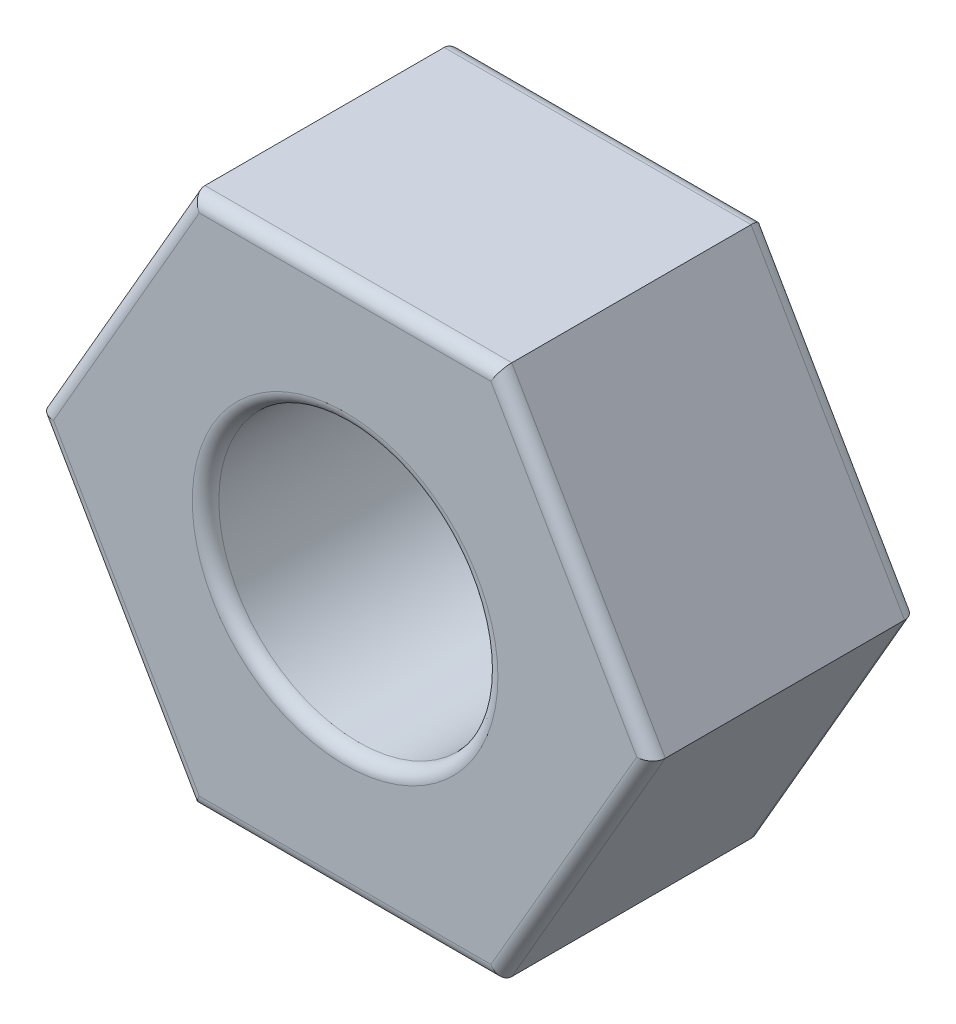
ISO-10303-21;
HEADER;
FILE_DESCRIPTION(('STEP AP214'),'2;1');
FILE_NAME('part.step','',(''),(''),'','','');
FILE_SCHEMA(('AUTOMOTIVE_DESIGN { 1 0 10303 214 1 1 1 1 }'));
ENDSEC;
DATA;
#1=APPLICATION_CONTEXT('core data for automotive mechanical design processes');
#2=APPLICATION_PROTOCOL_DEFINITION('international standard','automotive_design',2000,#1);
#3=PRODUCT_CONTEXT('',#1,'mechanical');
#4=PRODUCT('Part','Part','',(#3));
#5=PRODUCT_RELATED_PRODUCT_CATEGORY('part','',(#4));
#6=PRODUCT_DEFINITION_FORMATION('','',#4);
#7=PRODUCT_DEFINITION_CONTEXT('part definition',#1,'design');
#8=PRODUCT_DEFINITION('design','',#6,#7);
#9=PRODUCT_DEFINITION_SHAPE('','',#8);
#10=(LENGTH_UNIT() NAMED_UNIT(*) SI_UNIT(.MILLI.,.METRE.));
#11=(NAMED_UNIT(*) PLANE_ANGLE_UNIT() SI_UNIT($,.RADIAN.));
#12=(NAMED_UNIT(*) SI_UNIT($,.STERADIAN.) SOLID_ANGLE_UNIT());
#13=UNCERTAINTY_MEASURE_WITH_UNIT(LENGTH_MEASURE(1.E-05),#10,'distance_accuracy_value','');
#14=(GEOMETRIC_REPRESENTATION_CONTEXT(3) GLOBAL_UNCERTAINTY_ASSIGNED_CONTEXT((#13)) GLOBAL_UNIT_ASSIGNED_CONTEXT((#10,
#11,#12)) REPRESENTATION_CONTEXT('',''));
#15=CARTESIAN_POINT('',(0.,0.,0.));
#16=DIRECTION('',(0.,0.,1.));
#17=DIRECTION('',(1.,0.,0.));
#18=AXIS2_PLACEMENT_3D('',#15,#16,#17);
#19=CARTESIAN_POINT('',(0.,0.,4.));
#20=DIRECTION('',(0.,0.,1.));
#21=DIRECTION('',(1.,0.,0.));
#22=AXIS2_PLACEMENT_3D('',#19,#20,#21);
#23=PLANE('',#22);
#24=CARTESIAN_POINT('',(0.,0.,4.));
#25=DIRECTION('',(0.,0.,1.));
#26=DIRECTION('',(1.,0.,0.));
#27=AXIS2_PLACEMENT_3D('',#24,#25,#26);
#28=CIRCLE('',#27,2.3);
#29=CARTESIAN_POINT('',(2.3,0.,4.));
#30=VERTEX_POINT('',#29);
#31=EDGE_CURVE('E11',#30,#30,#28,.F.);
#32=ORIENTED_EDGE('',*,*,#31,.T.);
#33=EDGE_LOOP('',(#32));
#34=FACE_BOUND('',#33,.T.);
#35=DIRECTION('',(0.5,-0.866025403784439,0.));
#36=VECTOR('',#35,1.);
#37=CARTESIAN_POINT('',(-2.13619599600161,-3.9,4.));
#38=LINE('',#37,#36);
#39=CARTESIAN_POINT('',(-4.38786204584116,0.,4.));
#40=VERTEX_POINT('',#39);
#41=CARTESIAN_POINT('',(-2.19393102292058,-3.8,4.));
#42=VERTEX_POINT('',#41);
#43=EDGE_CURVE('E51',#40,#42,#38,.T.);
#44=ORIENTED_EDGE('',*,*,#43,.T.);
#45=DIRECTION('',(1.,0.,0.));
#46=VECTOR('',#45,1.);
#47=CARTESIAN_POINT('',(2.3094010767585,-3.8,4.));
#48=LINE('',#47,#46);
#49=CARTESIAN_POINT('',(2.19393102292058,-3.8,4.));
#50=VERTEX_POINT('',#49);
#51=EDGE_CURVE('E43',#42,#50,#48,.T.);
#52=ORIENTED_EDGE('',*,*,#51,.T.);
#53=DIRECTION('',(0.499999999999999,0.866025403784439,0.));
#54=VECTOR('',#53,1.);
#55=CARTESIAN_POINT('',(4.44559707276012,0.100000000000003,4.));
#56=LINE('',#55,#54);
#57=CARTESIAN_POINT('',(4.38786204584116,0.,4.));
#58=VERTEX_POINT('',#57);
#59=EDGE_CURVE('E190',#50,#58,#56,.T.);
#60=ORIENTED_EDGE('',*,*,#59,.T.);
#61=DIRECTION('',(-0.5,0.866025403784439,0.));
#62=VECTOR('',#61,1.);
#63=CARTESIAN_POINT('',(2.13619599600161,3.9,4.));
#64=LINE('',#63,#62);
#65=CARTESIAN_POINT('',(2.19393102292058,3.8,4.));
#66=VERTEX_POINT('',#65);
#67=EDGE_CURVE('E192',#58,#66,#64,.T.);
#68=ORIENTED_EDGE('',*,*,#67,.T.);
#69=DIRECTION('',(-1.,0.,0.));
#70=VECTOR('',#69,1.);
#71=CARTESIAN_POINT('',(-2.3094010767585,3.8,4.));
#72=LINE('',#71,#70);
#73=CARTESIAN_POINT('',(-2.19393102292058,3.8,4.));
#74=VERTEX_POINT('',#73);
#75=EDGE_CURVE('E194',#66,#74,#72,.T.);
#76=ORIENTED_EDGE('',*,*,#75,.T.);
#77=DIRECTION('',(-0.499999999999999,-0.866025403784439,0.));
#78=VECTOR('',#77,1.);
#79=CARTESIAN_POINT('',(-4.44559707276012,-0.100000000000003,4.));
#80=LINE('',#79,#78);
#81=EDGE_CURVE('E56',#74,#40,#80,.T.);
#82=ORIENTED_EDGE('',*,*,#81,.T.);
#83=EDGE_LOOP('',(#44,#52,#60,#68,#76,#82));
#84=FACE_BOUND('',#83,.T.);
#85=ADVANCED_FACE('F34',(#34,#84),#23,.T.);
#86=CARTESIAN_POINT('',(0.,0.,0.));
#87=DIRECTION('',(0.,0.,1.));
#88=DIRECTION('',(1.,0.,0.));
#89=AXIS2_PLACEMENT_3D('',#86,#87,#88);
#90=PLANE('',#89);
#91=CARTESIAN_POINT('',(0.,0.,0.));
#92=DIRECTION('',(0.,0.,1.));
#93=DIRECTION('',(1.,0.,0.));
#94=AXIS2_PLACEMENT_3D('',#91,#92,#93);
#95=CIRCLE('',#94,2.3);
#96=CARTESIAN_POINT('',(2.3,0.,0.));
#97=VERTEX_POINT('',#96);
#98=EDGE_CURVE('E152',#97,#97,#95,.T.);
#99=ORIENTED_EDGE('',*,*,#98,.T.);
#100=EDGE_LOOP('',(#99));
#101=FACE_BOUND('',#100,.T.);
#102=DIRECTION('',(-1.,0.,0.));
#103=VECTOR('',#102,1.);
#104=CARTESIAN_POINT('',(0.,3.8,0.));
#105=LINE('',#104,#103);
#106=CARTESIAN_POINT('',(-2.19393102292058,3.8,0.));
#107=VERTEX_POINT('',#106);
#108=CARTESIAN_POINT('',(2.19393102292058,3.8,0.));
#109=VERTEX_POINT('',#108);
#110=EDGE_CURVE('E151',#107,#109,#105,.F.);
#111=ORIENTED_EDGE('',*,*,#110,.T.);
#112=DIRECTION('',(-0.5,0.866025403784439,0.));
#113=VECTOR('',#112,1.);
#114=CARTESIAN_POINT('',(3.29089653438087,1.9,0.));
#115=LINE('',#114,#113);
#116=CARTESIAN_POINT('',(4.38786204584116,0.,0.));
#117=VERTEX_POINT('',#116);
#118=EDGE_CURVE('E130',#109,#117,#115,.F.);
#119=ORIENTED_EDGE('',*,*,#118,.T.);
#120=DIRECTION('',(0.499999999999999,0.866025403784439,0.));
#121=VECTOR('',#120,1.);
#122=CARTESIAN_POINT('',(3.29089653438087,-1.9,0.));
#123=LINE('',#122,#121);
#124=CARTESIAN_POINT('',(2.19393102292058,-3.8,0.));
#125=VERTEX_POINT('',#124);
#126=EDGE_CURVE('E140',#117,#125,#123,.F.);
#127=ORIENTED_EDGE('',*,*,#126,.T.);
#128=DIRECTION('',(1.,0.,0.));
#129=VECTOR('',#128,1.);
#130=CARTESIAN_POINT('',(0.,-3.8,0.));
#131=LINE('',#130,#129);
#132=CARTESIAN_POINT('',(-2.19393102292058,-3.8,0.));
#133=VERTEX_POINT('',#132);
#134=EDGE_CURVE('E146',#125,#133,#131,.F.);
#135=ORIENTED_EDGE('',*,*,#134,.T.);
#136=DIRECTION('',(0.5,-0.866025403784439,0.));
#137=VECTOR('',#136,1.);
#138=CARTESIAN_POINT('',(-3.29089653438087,-1.9,0.));
#139=LINE('',#138,#137);
#140=CARTESIAN_POINT('',(-4.38786204584116,0.,0.));
#141=VERTEX_POINT('',#140);
#142=EDGE_CURVE('E252',#133,#141,#139,.F.);
#143=ORIENTED_EDGE('',*,*,#142,.T.);
#144=DIRECTION('',(-0.499999999999999,-0.866025403784439,0.));
#145=VECTOR('',#144,1.);
#146=CARTESIAN_POINT('',(-3.29089653438087,1.9,0.));
#147=LINE('',#146,#145);
#148=EDGE_CURVE('E157',#141,#107,#147,.F.);
#149=ORIENTED_EDGE('',*,*,#148,.T.);
#150=EDGE_LOOP('',(#111,#119,#127,#135,#143,#149));
#151=FACE_BOUND('',#150,.T.);
#152=ADVANCED_FACE('F149',(#101,#151),#90,.F.);
#153=CARTESIAN_POINT('',(2.3094010767585,-4.,4.));
#154=DIRECTION('',(-0.866025403784439,0.499999999999999,0.));
#155=DIRECTION('',(-0.499999999999999,-0.866025403784439,0.));
#156=AXIS2_PLACEMENT_3D('',#153,#154,#155);
#157=PLANE('',#156);
#158=DIRECTION('',(0.,0.,-1.));
#159=VECTOR('',#158,1.);
#160=CARTESIAN_POINT('',(2.3094010767585,-4.,4.));
#161=LINE('',#160,#159);
#162=CARTESIAN_POINT('',(2.3094010767585,-4.,3.8));
#163=VERTEX_POINT('',#162);
#164=CARTESIAN_POINT('',(2.3094010767585,-4.,0.2));
#165=VERTEX_POINT('',#164);
#166=EDGE_CURVE('E209',#163,#165,#161,.T.);
#167=ORIENTED_EDGE('',*,*,#166,.T.);
#168=DIRECTION('',(0.499999999999999,0.866025403784439,0.));
#169=VECTOR('',#168,1.);
#170=CARTESIAN_POINT('',(2.3094010767585,-4.,0.2));
#171=LINE('',#170,#169);
#172=CARTESIAN_POINT('',(4.61880215351701,0.,0.2));
#173=VERTEX_POINT('',#172);
#174=EDGE_CURVE('E188',#165,#173,#171,.T.);
#175=ORIENTED_EDGE('',*,*,#174,.T.);
#176=DIRECTION('',(0.,0.,-1.));
#177=VECTOR('',#176,1.);
#178=CARTESIAN_POINT('',(4.61880215351701,0.,4.));
#179=LINE('',#178,#177);
#180=CARTESIAN_POINT('',(4.61880215351701,0.,3.8));
#181=VERTEX_POINT('',#180);
#182=EDGE_CURVE('E147',#181,#173,#179,.T.);
#183=ORIENTED_EDGE('',*,*,#182,.F.);
#184=DIRECTION('',(0.499999999999999,0.866025403784439,0.));
#185=VECTOR('',#184,1.);
#186=CARTESIAN_POINT('',(2.3094010767585,-4.,3.8));
#187=LINE('',#186,#185);
#188=EDGE_CURVE('E186',#181,#163,#187,.F.);
#189=ORIENTED_EDGE('',*,*,#188,.T.);
#190=EDGE_LOOP('',(#167,#175,#183,#189));
#191=FACE_BOUND('',#190,.T.);
#192=ADVANCED_FACE('F276',(#191),#157,.F.);
#193=CARTESIAN_POINT('',(4.61880215351701,0.,4.));
#194=DIRECTION('',(-0.866025403784438,-0.5,0.));
#195=DIRECTION('',(0.5,-0.866025403784439,0.));
#196=AXIS2_PLACEMENT_3D('',#193,#194,#195);
#197=PLANE('',#196);
#198=ORIENTED_EDGE('',*,*,#182,.T.);
#199=DIRECTION('',(-0.5,0.866025403784439,0.));
#200=VECTOR('',#199,1.);
#201=CARTESIAN_POINT('',(4.61880215351701,0.,0.2));
#202=LINE('',#201,#200);
#203=CARTESIAN_POINT('',(2.3094010767585,4.,0.2));
#204=VERTEX_POINT('',#203);
#205=EDGE_CURVE('E133',#173,#204,#202,.T.);
#206=ORIENTED_EDGE('',*,*,#205,.T.);
#207=DIRECTION('',(0.,0.,-1.));
#208=VECTOR('',#207,1.);
#209=CARTESIAN_POINT('',(2.3094010767585,4.,4.));
#210=LINE('',#209,#208);
#211=CARTESIAN_POINT('',(2.3094010767585,4.,3.8));
#212=VERTEX_POINT('',#211);
#213=EDGE_CURVE('E238',#212,#204,#210,.T.);
#214=ORIENTED_EDGE('',*,*,#213,.F.);
#215=DIRECTION('',(-0.5,0.866025403784439,0.));
#216=VECTOR('',#215,1.);
#217=CARTESIAN_POINT('',(4.61880215351701,0.,3.8));
#218=LINE('',#217,#216);
#219=EDGE_CURVE('E166',#212,#181,#218,.F.);
#220=ORIENTED_EDGE('',*,*,#219,.T.);
#221=EDGE_LOOP('',(#198,#206,#214,#220));
#222=FACE_BOUND('',#221,.T.);
#223=ADVANCED_FACE('F243',(#222),#197,.F.);
#224=CARTESIAN_POINT('',(2.3094010767585,4.,4.));
#225=DIRECTION('',(0.,-1.,0.));
#226=DIRECTION('',(0.,0.,-1.));
#227=AXIS2_PLACEMENT_3D('',#224,#225,#226);
#228=PLANE('',#227);
#229=ORIENTED_EDGE('',*,*,#213,.T.);
#230=DIRECTION('',(-1.,0.,0.));
#231=VECTOR('',#230,1.);
#232=CARTESIAN_POINT('',(2.3094010767585,4.,0.2));
#233=LINE('',#232,#231);
#234=CARTESIAN_POINT('',(-2.3094010767585,4.,0.2));
#235=VERTEX_POINT('',#234);
#236=EDGE_CURVE('E171',#204,#235,#233,.T.);
#237=ORIENTED_EDGE('',*,*,#236,.T.);
#238=DIRECTION('',(0.,0.,-1.));
#239=VECTOR('',#238,1.);
#240=CARTESIAN_POINT('',(-2.3094010767585,4.,4.));
#241=LINE('',#240,#239);
#242=CARTESIAN_POINT('',(-2.3094010767585,4.,3.8));
#243=VERTEX_POINT('',#242);
#244=EDGE_CURVE('E240',#243,#235,#241,.T.);
#245=ORIENTED_EDGE('',*,*,#244,.F.);
#246=DIRECTION('',(-1.,0.,0.));
#247=VECTOR('',#246,1.);
#248=CARTESIAN_POINT('',(2.3094010767585,4.,3.8));
#249=LINE('',#248,#247);
#250=EDGE_CURVE('E169',#243,#212,#249,.F.);
#251=ORIENTED_EDGE('',*,*,#250,.T.);
#252=EDGE_LOOP('',(#229,#237,#245,#251));
#253=FACE_BOUND('',#252,.T.);
#254=ADVANCED_FACE('F237',(#253),#228,.F.);
#255=CARTESIAN_POINT('',(-2.3094010767585,4.,4.));
#256=DIRECTION('',(0.866025403784439,-0.499999999999999,0.));
#257=DIRECTION('',(0.499999999999999,0.866025403784439,0.));
#258=AXIS2_PLACEMENT_3D('',#255,#256,#257);
#259=PLANE('',#258);
#260=ORIENTED_EDGE('',*,*,#244,.T.);
#261=DIRECTION('',(-0.499999999999999,-0.866025403784439,0.));
#262=VECTOR('',#261,1.);
#263=CARTESIAN_POINT('',(-2.3094010767585,4.,0.2));
#264=LINE('',#263,#262);
#265=CARTESIAN_POINT('',(-4.61880215351701,0.,0.2));
#266=VERTEX_POINT('',#265);
#267=EDGE_CURVE('E175',#235,#266,#264,.T.);
#268=ORIENTED_EDGE('',*,*,#267,.T.);
#269=DIRECTION('',(0.,0.,-1.));
#270=VECTOR('',#269,1.);
#271=CARTESIAN_POINT('',(-4.61880215351701,0.,4.));
#272=LINE('',#271,#270);
#273=CARTESIAN_POINT('',(-4.61880215351701,0.,3.8));
#274=VERTEX_POINT('',#273);
#275=EDGE_CURVE('E247',#274,#266,#272,.T.);
#276=ORIENTED_EDGE('',*,*,#275,.F.);
#277=DIRECTION('',(-0.499999999999999,-0.866025403784439,0.));
#278=VECTOR('',#277,1.);
#279=CARTESIAN_POINT('',(-2.3094010767585,4.,3.8));
#280=LINE('',#279,#278);
#281=EDGE_CURVE('E173',#274,#243,#280,.F.);
#282=ORIENTED_EDGE('',*,*,#281,.T.);
#283=EDGE_LOOP('',(#260,#268,#276,#282));
#284=FACE_BOUND('',#283,.T.);
#285=ADVANCED_FACE('F264',(#284),#259,.F.);
#286=CARTESIAN_POINT('',(-4.61880215351701,0.,4.));
#287=DIRECTION('',(0.866025403784438,0.5,0.));
#288=DIRECTION('',(-0.5,0.866025403784439,0.));
#289=AXIS2_PLACEMENT_3D('',#286,#287,#288);
#290=PLANE('',#289);
#291=ORIENTED_EDGE('',*,*,#275,.T.);
#292=DIRECTION('',(0.5,-0.866025403784439,0.));
#293=VECTOR('',#292,1.);
#294=CARTESIAN_POINT('',(-4.61880215351701,0.,0.2));
#295=LINE('',#294,#293);
#296=CARTESIAN_POINT('',(-2.3094010767585,-4.,0.2));
#297=VERTEX_POINT('',#296);
#298=EDGE_CURVE('E179',#266,#297,#295,.T.);
#299=ORIENTED_EDGE('',*,*,#298,.T.);
#300=DIRECTION('',(0.,0.,-1.));
#301=VECTOR('',#300,1.);
#302=CARTESIAN_POINT('',(-2.3094010767585,-4.,4.));
#303=LINE('',#302,#301);
#304=CARTESIAN_POINT('',(-2.3094010767585,-4.,3.8));
#305=VERTEX_POINT('',#304);
#306=EDGE_CURVE('E269',#305,#297,#303,.T.);
#307=ORIENTED_EDGE('',*,*,#306,.F.);
#308=DIRECTION('',(0.5,-0.866025403784439,0.));
#309=VECTOR('',#308,1.);
#310=CARTESIAN_POINT('',(-4.61880215351701,0.,3.8));
#311=LINE('',#310,#309);
#312=EDGE_CURVE('E177',#305,#274,#311,.F.);
#313=ORIENTED_EDGE('',*,*,#312,.T.);
#314=EDGE_LOOP('',(#291,#299,#307,#313));
#315=FACE_BOUND('',#314,.T.);
#316=ADVANCED_FACE('F287',(#315),#290,.F.);
#317=CARTESIAN_POINT('',(-2.3094010767585,-4.,4.));
#318=DIRECTION('',(0.,1.,0.));
#319=DIRECTION('',(-1.,0.,0.));
#320=AXIS2_PLACEMENT_3D('',#317,#318,#319);
#321=PLANE('',#320);
#322=ORIENTED_EDGE('',*,*,#306,.T.);
#323=DIRECTION('',(1.,0.,0.));
#324=VECTOR('',#323,1.);
#325=CARTESIAN_POINT('',(-2.3094010767585,-4.,0.2));
#326=LINE('',#325,#324);
#327=EDGE_CURVE('E184',#297,#165,#326,.T.);
#328=ORIENTED_EDGE('',*,*,#327,.T.);
#329=ORIENTED_EDGE('',*,*,#166,.F.);
#330=DIRECTION('',(1.,0.,0.));
#331=VECTOR('',#330,1.);
#332=CARTESIAN_POINT('',(-2.3094010767585,-4.,3.8));
#333=LINE('',#332,#331);
#334=EDGE_CURVE('E181',#163,#305,#333,.F.);
#335=ORIENTED_EDGE('',*,*,#334,.T.);
#336=EDGE_LOOP('',(#322,#328,#329,#335));
#337=FACE_BOUND('',#336,.T.);
#338=ADVANCED_FACE('F288',(#337),#321,.F.);
#339=CARTESIAN_POINT('',(0.,0.,4.));
#340=DIRECTION('',(0.,0.,-1.));
#341=DIRECTION('',(-1.,0.,0.));
#342=AXIS2_PLACEMENT_3D('',#339,#340,#341);
#343=CYLINDRICAL_SURFACE('',#342,2.1);
#344=CARTESIAN_POINT('',(0.,0.,0.2));
#345=DIRECTION('',(0.,0.,1.));
#346=DIRECTION('',(1.,0.,0.));
#347=AXIS2_PLACEMENT_3D('',#344,#345,#346);
#348=CIRCLE('',#347,2.1);
#349=CARTESIAN_POINT('',(2.1,0.,0.2));
#350=VERTEX_POINT('',#349);
#351=EDGE_CURVE('E163',#350,#350,#348,.F.);
#352=ORIENTED_EDGE('',*,*,#351,.T.);
#353=EDGE_LOOP('',(#352));
#354=FACE_BOUND('',#353,.T.);
#355=CARTESIAN_POINT('',(0.,0.,3.8));
#356=DIRECTION('',(0.,0.,1.));
#357=DIRECTION('',(1.,0.,0.));
#358=AXIS2_PLACEMENT_3D('',#355,#356,#357);
#359=CIRCLE('',#358,2.1);
#360=CARTESIAN_POINT('',(2.1,0.,3.8));
#361=VERTEX_POINT('',#360);
#362=EDGE_CURVE('E155',#361,#361,#359,.T.);
#363=ORIENTED_EDGE('',*,*,#362,.T.);
#364=EDGE_LOOP('',(#363));
#365=FACE_BOUND('',#364,.T.);
#366=ADVANCED_FACE('F307',(#354,#365),#343,.F.);
#367=CARTESIAN_POINT('',(0.,0.,0.2));
#368=DIRECTION('',(0.,0.,1.));
#369=DIRECTION('',(1.,0.,0.));
#370=AXIS2_PLACEMENT_3D('',#367,#368,#369);
#371=TOROIDAL_SURFACE('',#370,2.3,0.2);
#372=ORIENTED_EDGE('',*,*,#351,.F.);
#373=EDGE_LOOP('',(#372));
#374=FACE_BOUND('',#373,.T.);
#375=ORIENTED_EDGE('',*,*,#98,.F.);
#376=EDGE_LOOP('',(#375));
#377=FACE_BOUND('',#376,.T.);
#378=ADVANCED_FACE('F321',(#374,#377),#371,.T.);
#379=CARTESIAN_POINT('',(-4.44559707276012,0.0999999999999967,0.2));
#380=DIRECTION('',(0.5,-0.866025403784439,0.));
#381=DIRECTION('',(0.866025403784438,0.5,0.));
#382=AXIS2_PLACEMENT_3D('',#379,#380,#381);
#383=CYLINDRICAL_SURFACE('',#382,0.2);
#384=CARTESIAN_POINT('',(-4.38786204584116,0.,0.2));
#385=DIRECTION('',(0.,-1.,0.));
#386=DIRECTION('',(1.,0.,0.));
#387=AXIS2_PLACEMENT_3D('',#384,#385,#386);
#388=ELLIPSE('',#387,0.23094010767585,0.2);
#389=EDGE_CURVE('E203',#141,#266,#388,.F.);
#390=ORIENTED_EDGE('',*,*,#389,.F.);
#391=ORIENTED_EDGE('',*,*,#142,.F.);
#392=CARTESIAN_POINT('',(-2.19393102292058,-3.8,0.2));
#393=DIRECTION('',(0.866025403784439,-0.5,0.));
#394=DIRECTION('',(0.5,0.866025403784439,0.));
#395=AXIS2_PLACEMENT_3D('',#392,#393,#394);
#396=ELLIPSE('',#395,0.23094010767585,0.2);
#397=EDGE_CURVE('E206',#297,#133,#396,.T.);
#398=ORIENTED_EDGE('',*,*,#397,.F.);
#399=ORIENTED_EDGE('',*,*,#298,.F.);
#400=EDGE_LOOP('',(#390,#391,#398,#399));
#401=FACE_BOUND('',#400,.T.);
#402=ADVANCED_FACE('F285',(#401),#383,.T.);
#403=CARTESIAN_POINT('',(-2.3094010767585,-3.8,0.2));
#404=DIRECTION('',(1.,0.,0.));
#405=DIRECTION('',(0.,1.,0.));
#406=AXIS2_PLACEMENT_3D('',#403,#404,#405);
#407=CYLINDRICAL_SURFACE('',#406,0.2);
#408=ORIENTED_EDGE('',*,*,#397,.T.);
#409=ORIENTED_EDGE('',*,*,#134,.F.);
#410=CARTESIAN_POINT('',(2.19393102292058,-3.8,0.2));
#411=DIRECTION('',(0.866025403784438,0.5,0.));
#412=DIRECTION('',(-0.5,0.866025403784438,0.));
#413=AXIS2_PLACEMENT_3D('',#410,#411,#412);
#414=ELLIPSE('',#413,0.23094010767585,0.2);
#415=EDGE_CURVE('E143',#165,#125,#414,.T.);
#416=ORIENTED_EDGE('',*,*,#415,.F.);
#417=ORIENTED_EDGE('',*,*,#327,.F.);
#418=EDGE_LOOP('',(#408,#409,#416,#417));
#419=FACE_BOUND('',#418,.T.);
#420=ADVANCED_FACE('F282',(#419),#407,.T.);
#421=CARTESIAN_POINT('',(-2.13619599600162,3.9,0.2));
#422=DIRECTION('',(-0.499999999999999,-0.866025403784439,0.));
#423=DIRECTION('',(0.866025403784439,-0.499999999999999,0.));
#424=AXIS2_PLACEMENT_3D('',#421,#422,#423);
#425=CYLINDRICAL_SURFACE('',#424,0.2);
#426=ORIENTED_EDGE('',*,*,#389,.T.);
#427=ORIENTED_EDGE('',*,*,#267,.F.);
#428=CARTESIAN_POINT('',(-2.19393102292058,3.8,0.2));
#429=DIRECTION('',(-0.866025403784438,-0.5,0.));
#430=DIRECTION('',(0.5,-0.866025403784438,0.));
#431=AXIS2_PLACEMENT_3D('',#428,#429,#430);
#432=ELLIPSE('',#431,0.23094010767585,0.2);
#433=EDGE_CURVE('E136',#107,#235,#432,.F.);
#434=ORIENTED_EDGE('',*,*,#433,.F.);
#435=ORIENTED_EDGE('',*,*,#148,.F.);
#436=EDGE_LOOP('',(#426,#427,#434,#435));
#437=FACE_BOUND('',#436,.T.);
#438=ADVANCED_FACE('F259',(#437),#425,.T.);
#439=CARTESIAN_POINT('',(2.13619599600162,-3.9,0.2));
#440=DIRECTION('',(0.499999999999999,0.866025403784439,0.));
#441=DIRECTION('',(-0.866025403784439,0.499999999999999,0.));
#442=AXIS2_PLACEMENT_3D('',#439,#440,#441);
#443=CYLINDRICAL_SURFACE('',#442,0.2);
#444=ORIENTED_EDGE('',*,*,#415,.T.);
#445=ORIENTED_EDGE('',*,*,#126,.F.);
#446=CARTESIAN_POINT('',(4.38786204584116,0.,0.2));
#447=DIRECTION('',(0.,1.,0.));
#448=DIRECTION('',(1.,0.,0.));
#449=AXIS2_PLACEMENT_3D('',#446,#447,#448);
#450=ELLIPSE('',#449,0.23094010767585,0.2);
#451=EDGE_CURVE('E126',#173,#117,#450,.T.);
#452=ORIENTED_EDGE('',*,*,#451,.F.);
#453=ORIENTED_EDGE('',*,*,#174,.F.);
#454=EDGE_LOOP('',(#444,#445,#452,#453));
#455=FACE_BOUND('',#454,.T.);
#456=ADVANCED_FACE('F141',(#455),#443,.T.);
#457=CARTESIAN_POINT('',(2.3094010767585,3.8,0.2));
#458=DIRECTION('',(-1.,0.,0.));
#459=DIRECTION('',(0.,0.,1.));
#460=AXIS2_PLACEMENT_3D('',#457,#458,#459);
#461=CYLINDRICAL_SURFACE('',#460,0.2);
#462=ORIENTED_EDGE('',*,*,#433,.T.);
#463=ORIENTED_EDGE('',*,*,#236,.F.);
#464=CARTESIAN_POINT('',(2.19393102292058,3.8,0.2));
#465=DIRECTION('',(-0.866025403784439,0.5,0.));
#466=DIRECTION('',(-0.5,-0.866025403784439,0.));
#467=AXIS2_PLACEMENT_3D('',#464,#465,#466);
#468=ELLIPSE('',#467,0.23094010767585,0.2);
#469=EDGE_CURVE('E137',#109,#204,#468,.F.);
#470=ORIENTED_EDGE('',*,*,#469,.F.);
#471=ORIENTED_EDGE('',*,*,#110,.F.);
#472=EDGE_LOOP('',(#462,#463,#470,#471));
#473=FACE_BOUND('',#472,.T.);
#474=ADVANCED_FACE('F262',(#473),#461,.T.);
#475=CARTESIAN_POINT('',(4.44559707276012,-0.0999999999999971,0.2));
#476=DIRECTION('',(-0.5,0.866025403784439,0.));
#477=DIRECTION('',(-0.866025403784438,-0.5,0.));
#478=AXIS2_PLACEMENT_3D('',#475,#476,#477);
#479=CYLINDRICAL_SURFACE('',#478,0.2);
#480=ORIENTED_EDGE('',*,*,#451,.T.);
#481=ORIENTED_EDGE('',*,*,#118,.F.);
#482=ORIENTED_EDGE('',*,*,#469,.T.);
#483=ORIENTED_EDGE('',*,*,#205,.F.);
#484=EDGE_LOOP('',(#480,#481,#482,#483));
#485=FACE_BOUND('',#484,.T.);
#486=ADVANCED_FACE('F128',(#485),#479,.T.);
#487=CARTESIAN_POINT('',(0.,0.,3.8));
#488=DIRECTION('',(0.,0.,1.));
#489=DIRECTION('',(1.,0.,0.));
#490=AXIS2_PLACEMENT_3D('',#487,#488,#489);
#491=TOROIDAL_SURFACE('',#490,2.3,0.2);
#492=ORIENTED_EDGE('',*,*,#31,.F.);
#493=EDGE_LOOP('',(#492));
#494=FACE_BOUND('',#493,.T.);
#495=ORIENTED_EDGE('',*,*,#362,.F.);
#496=EDGE_LOOP('',(#495));
#497=FACE_BOUND('',#496,.T.);
#498=ADVANCED_FACE('F327',(#494,#497),#491,.T.);
#499=CARTESIAN_POINT('',(0.,3.8,3.8));
#500=DIRECTION('',(1.,0.,0.));
#501=DIRECTION('',(0.,0.,-1.));
#502=AXIS2_PLACEMENT_3D('',#499,#500,#501);
#503=CYLINDRICAL_SURFACE('',#502,0.2);
#504=CARTESIAN_POINT('',(2.19393102292058,3.8,3.8));
#505=DIRECTION('',(0.866025403784439,-0.5,0.));
#506=DIRECTION('',(-0.5,-0.866025403784439,0.));
#507=AXIS2_PLACEMENT_3D('',#504,#505,#506);
#508=ELLIPSE('',#507,0.23094010767585,0.2);
#509=EDGE_CURVE('E219',#212,#66,#508,.T.);
#510=ORIENTED_EDGE('',*,*,#509,.F.);
#511=ORIENTED_EDGE('',*,*,#250,.F.);
#512=CARTESIAN_POINT('',(-2.19393102292058,3.8,3.8));
#513=DIRECTION('',(0.866025403784438,0.5,0.));
#514=DIRECTION('',(0.5,-0.866025403784438,0.));
#515=AXIS2_PLACEMENT_3D('',#512,#513,#514);
#516=ELLIPSE('',#515,0.23094010767585,0.2);
#517=EDGE_CURVE('E38',#74,#243,#516,.F.);
#518=ORIENTED_EDGE('',*,*,#517,.F.);
#519=ORIENTED_EDGE('',*,*,#75,.F.);
#520=EDGE_LOOP('',(#510,#511,#518,#519));
#521=FACE_BOUND('',#520,.T.);
#522=ADVANCED_FACE('F36',(#521),#503,.T.);
#523=CARTESIAN_POINT('',(-3.29089653438087,1.9,3.8));
#524=DIRECTION('',(0.499999999999999,0.866025403784439,0.));
#525=DIRECTION('',(-0.866025403784439,0.499999999999999,0.));
#526=AXIS2_PLACEMENT_3D('',#523,#524,#525);
#527=CYLINDRICAL_SURFACE('',#526,0.2);
#528=ORIENTED_EDGE('',*,*,#517,.T.);
#529=ORIENTED_EDGE('',*,*,#281,.F.);
#530=CARTESIAN_POINT('',(-4.38786204584116,0.,3.8));
#531=DIRECTION('',(0.,1.,0.));
#532=DIRECTION('',(1.,0.,0.));
#533=AXIS2_PLACEMENT_3D('',#530,#531,#532);
#534=ELLIPSE('',#533,0.23094010767585,0.2);
#535=EDGE_CURVE('E217',#40,#274,#534,.F.);
#536=ORIENTED_EDGE('',*,*,#535,.F.);
#537=ORIENTED_EDGE('',*,*,#81,.F.);
#538=EDGE_LOOP('',(#528,#529,#536,#537));
#539=FACE_BOUND('',#538,.T.);
#540=ADVANCED_FACE('F229',(#539),#527,.T.);
#541=CARTESIAN_POINT('',(3.29089653438087,1.9,3.8));
#542=DIRECTION('',(0.5,-0.866025403784439,0.));
#543=DIRECTION('',(0.866025403784438,0.5,0.));
#544=AXIS2_PLACEMENT_3D('',#541,#542,#543);
#545=CYLINDRICAL_SURFACE('',#544,0.2);
#546=ORIENTED_EDGE('',*,*,#509,.T.);
#547=ORIENTED_EDGE('',*,*,#67,.F.);
#548=CARTESIAN_POINT('',(4.38786204584116,0.,3.8));
#549=DIRECTION('',(0.,-1.,0.));
#550=DIRECTION('',(-1.,0.,0.));
#551=AXIS2_PLACEMENT_3D('',#548,#549,#550);
#552=ELLIPSE('',#551,0.23094010767585,0.2);
#553=EDGE_CURVE('E214',#181,#58,#552,.T.);
#554=ORIENTED_EDGE('',*,*,#553,.F.);
#555=ORIENTED_EDGE('',*,*,#219,.F.);
#556=EDGE_LOOP('',(#546,#547,#554,#555));
#557=FACE_BOUND('',#556,.T.);
#558=ADVANCED_FACE('F348',(#557),#545,.T.);
#559=CARTESIAN_POINT('',(-3.29089653438087,-1.9,3.8));
#560=DIRECTION('',(-0.5,0.866025403784439,0.));
#561=DIRECTION('',(-0.866025403784438,-0.5,0.));
#562=AXIS2_PLACEMENT_3D('',#559,#560,#561);
#563=CYLINDRICAL_SURFACE('',#562,0.2);
#564=ORIENTED_EDGE('',*,*,#535,.T.);
#565=ORIENTED_EDGE('',*,*,#312,.F.);
#566=CARTESIAN_POINT('',(-2.19393102292058,-3.8,3.8));
#567=DIRECTION('',(-0.866025403784439,0.5,0.));
#568=DIRECTION('',(0.5,0.866025403784439,0.));
#569=AXIS2_PLACEMENT_3D('',#566,#567,#568);
#570=ELLIPSE('',#569,0.23094010767585,0.2);
#571=EDGE_CURVE('E212',#42,#305,#570,.F.);
#572=ORIENTED_EDGE('',*,*,#571,.F.);
#573=ORIENTED_EDGE('',*,*,#43,.F.);
#574=EDGE_LOOP('',(#564,#565,#572,#573));
#575=FACE_BOUND('',#574,.T.);
#576=ADVANCED_FACE('F345',(#575),#563,.T.);
#577=CARTESIAN_POINT('',(3.29089653438087,-1.9,3.8));
#578=DIRECTION('',(-0.499999999999999,-0.866025403784439,0.));
#579=DIRECTION('',(0.866025403784439,-0.499999999999999,0.));
#580=AXIS2_PLACEMENT_3D('',#577,#578,#579);
#581=CYLINDRICAL_SURFACE('',#580,0.2);
#582=ORIENTED_EDGE('',*,*,#553,.T.);
#583=ORIENTED_EDGE('',*,*,#59,.F.);
#584=CARTESIAN_POINT('',(2.19393102292058,-3.8,3.8));
#585=DIRECTION('',(-0.866025403784438,-0.5,0.));
#586=DIRECTION('',(0.5,-0.866025403784438,0.));
#587=AXIS2_PLACEMENT_3D('',#584,#585,#586);
#588=ELLIPSE('',#587,0.23094010767585,0.2);
#589=EDGE_CURVE('E210',#163,#50,#588,.T.);
#590=ORIENTED_EDGE('',*,*,#589,.F.);
#591=ORIENTED_EDGE('',*,*,#188,.F.);
#592=EDGE_LOOP('',(#582,#583,#590,#591));
#593=FACE_BOUND('',#592,.T.);
#594=ADVANCED_FACE('F296',(#593),#581,.T.);
#595=CARTESIAN_POINT('',(0.,-3.8,3.8));
#596=DIRECTION('',(-1.,0.,0.));
#597=DIRECTION('',(0.,-1.,0.));
#598=AXIS2_PLACEMENT_3D('',#595,#596,#597);
#599=CYLINDRICAL_SURFACE('',#598,0.2);
#600=ORIENTED_EDGE('',*,*,#571,.T.);
#601=ORIENTED_EDGE('',*,*,#334,.F.);
#602=ORIENTED_EDGE('',*,*,#589,.T.);
#603=ORIENTED_EDGE('',*,*,#51,.F.);
#604=EDGE_LOOP('',(#600,#601,#602,#603));
#605=FACE_BOUND('',#604,.T.);
#606=ADVANCED_FACE('F291',(#605),#599,.T.);
#607=CLOSED_SHELL('',(#85,#152,#192,#223,#254,#285,#316,#338,#366,#378,#402,#420,#438,#456,#474,
#486,#498,#522,#540,#558,#576,#594,#606));
#608=MANIFOLD_SOLID_BREP('B2',#607);
#609=ADVANCED_BREP_SHAPE_REPRESENTATION('',(#18,#608),#14);
#610=SHAPE_DEFINITION_REPRESENTATION(#9,#609);
ENDSEC;
END-ISO-10303-21;
